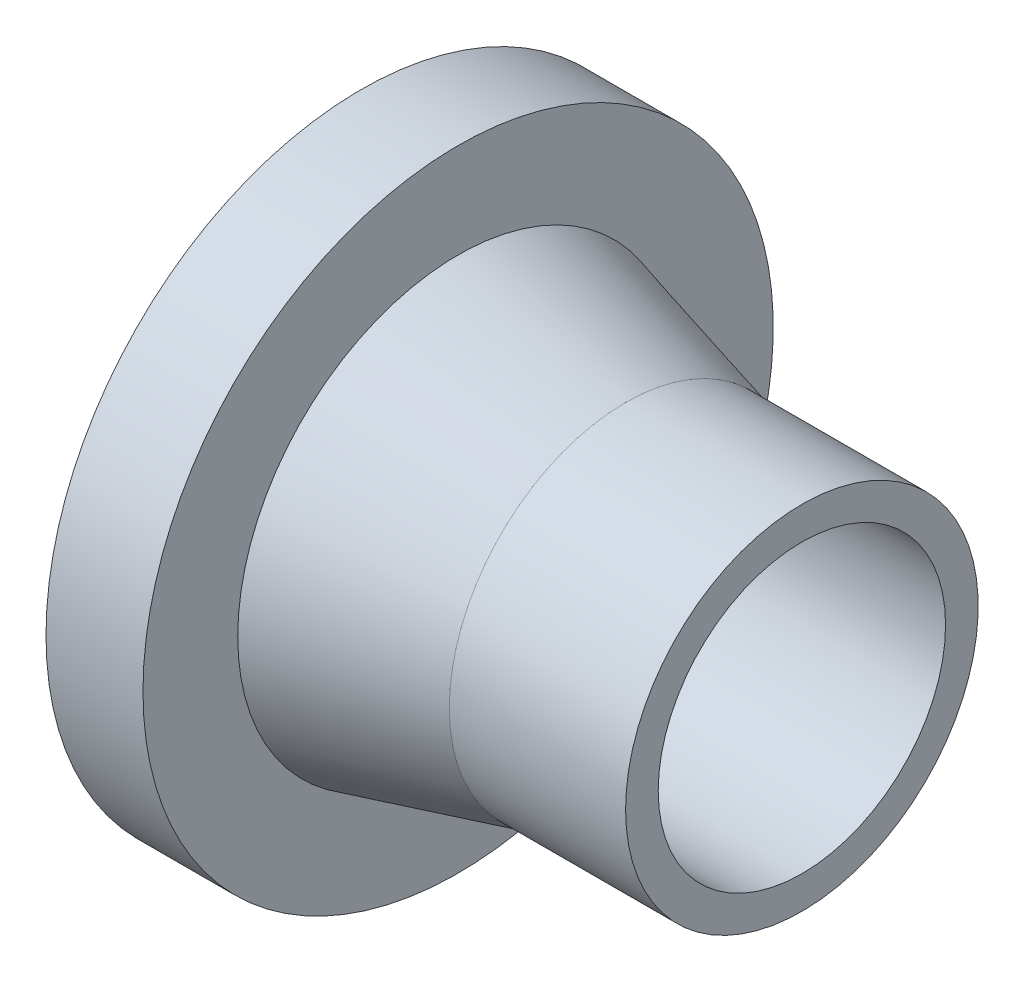
ISO-10303-21;
HEADER;
FILE_DESCRIPTION(('STEP AP214'),'2;1');
FILE_NAME('part.step','',(''),(''),'','','');
FILE_SCHEMA(('AUTOMOTIVE_DESIGN { 1 0 10303 214 1 1 1 1 }'));
ENDSEC;
DATA;
#1=APPLICATION_CONTEXT('core data for automotive mechanical design processes');
#2=APPLICATION_PROTOCOL_DEFINITION('international standard','automotive_design',2000,#1);
#3=PRODUCT_CONTEXT('',#1,'mechanical');
#4=PRODUCT('Part','Part','',(#3));
#5=PRODUCT_RELATED_PRODUCT_CATEGORY('part','',(#4));
#6=PRODUCT_DEFINITION_FORMATION('','',#4);
#7=PRODUCT_DEFINITION_CONTEXT('part definition',#1,'design');
#8=PRODUCT_DEFINITION('design','',#6,#7);
#9=PRODUCT_DEFINITION_SHAPE('','',#8);
#10=(LENGTH_UNIT() NAMED_UNIT(*) SI_UNIT(.MILLI.,.METRE.));
#11=(NAMED_UNIT(*) PLANE_ANGLE_UNIT() SI_UNIT($,.RADIAN.));
#12=(NAMED_UNIT(*) SI_UNIT($,.STERADIAN.) SOLID_ANGLE_UNIT());
#13=UNCERTAINTY_MEASURE_WITH_UNIT(LENGTH_MEASURE(1.E-05),#10,'distance_accuracy_value','');
#14=(GEOMETRIC_REPRESENTATION_CONTEXT(3) GLOBAL_UNCERTAINTY_ASSIGNED_CONTEXT((#13)) GLOBAL_UNIT_ASSIGNED_CONTEXT((#10,
#11,#12)) REPRESENTATION_CONTEXT('',''));
#15=CARTESIAN_POINT('',(0.,0.,0.));
#16=DIRECTION('',(0.,0.,1.));
#17=DIRECTION('',(1.,0.,0.));
#18=AXIS2_PLACEMENT_3D('',#15,#16,#17);
#19=CARTESIAN_POINT('',(-20.,0.,0.));
#20=DIRECTION('',(-1.,0.,0.));
#21=DIRECTION('',(0.,0.,1.));
#22=AXIS2_PLACEMENT_3D('',#19,#20,#21);
#23=CONICAL_SURFACE('',#22,20.,0.257323714971089);
#24=CARTESIAN_POINT('',(-39.,0.,0.));
#25=DIRECTION('',(-1.,0.,0.));
#26=DIRECTION('',(0.,0.,1.));
#27=AXIS2_PLACEMENT_3D('',#24,#25,#26);
#28=CIRCLE('',#27,25.);
#29=CARTESIAN_POINT('',(-39.,0.,25.));
#30=VERTEX_POINT('',#29);
#31=EDGE_CURVE('E16',#30,#30,#28,.T.);
#32=ORIENTED_EDGE('',*,*,#31,.F.);
#33=EDGE_LOOP('',(#32));
#34=FACE_BOUND('',#33,.T.);
#35=CARTESIAN_POINT('',(-20.,0.,0.));
#36=DIRECTION('',(-1.,0.,0.));
#37=DIRECTION('',(0.,1.,0.));
#38=AXIS2_PLACEMENT_3D('',#35,#36,#37);
#39=CIRCLE('',#38,20.);
#40=CARTESIAN_POINT('',(-20.,20.,0.));
#41=VERTEX_POINT('',#40);
#42=EDGE_CURVE('E28',#41,#41,#39,.F.);
#43=ORIENTED_EDGE('',*,*,#42,.F.);
#44=EDGE_LOOP('',(#43));
#45=FACE_BOUND('',#44,.T.);
#46=ADVANCED_FACE('F13',(#34,#45),#23,.T.);
#47=CARTESIAN_POINT('',(-39.,35.75,36.1790021083975));
#48=DIRECTION('',(1.,0.,0.));
#49=DIRECTION('',(0.,-1.,0.));
#50=AXIS2_PLACEMENT_3D('',#47,#48,#49);
#51=PLANE('',#50);
#52=ORIENTED_EDGE('',*,*,#31,.T.);
#53=EDGE_LOOP('',(#52));
#54=FACE_BOUND('',#53,.T.);
#55=CARTESIAN_POINT('',(-39.,0.,0.));
#56=DIRECTION('',(-1.,0.,0.));
#57=DIRECTION('',(0.,0.,1.));
#58=AXIS2_PLACEMENT_3D('',#55,#56,#57);
#59=CIRCLE('',#58,35.75);
#60=CARTESIAN_POINT('',(-39.,0.,35.75));
#61=VERTEX_POINT('',#60);
#62=EDGE_CURVE('E34',#61,#61,#59,.T.);
#63=ORIENTED_EDGE('',*,*,#62,.F.);
#64=EDGE_LOOP('',(#63));
#65=FACE_BOUND('',#64,.T.);
#66=ADVANCED_FACE('F44',(#54,#65),#51,.T.);
#67=CARTESIAN_POINT('',(-20.,0.,0.));
#68=DIRECTION('',(-1.,0.,0.));
#69=DIRECTION('',(0.,0.,1.));
#70=AXIS2_PLACEMENT_3D('',#67,#68,#69);
#71=CYLINDRICAL_SURFACE('',#70,20.);
#72=ORIENTED_EDGE('',*,*,#42,.T.);
#73=EDGE_LOOP('',(#72));
#74=FACE_BOUND('',#73,.T.);
#75=CARTESIAN_POINT('',(0.,0.,0.));
#76=DIRECTION('',(-1.,0.,0.));
#77=DIRECTION('',(0.,0.,1.));
#78=AXIS2_PLACEMENT_3D('',#75,#76,#77);
#79=CIRCLE('',#78,20.);
#80=CARTESIAN_POINT('',(0.,0.,20.));
#81=VERTEX_POINT('',#80);
#82=EDGE_CURVE('E32',#81,#81,#79,.F.);
#83=ORIENTED_EDGE('',*,*,#82,.F.);
#84=EDGE_LOOP('',(#83));
#85=FACE_BOUND('',#84,.T.);
#86=ADVANCED_FACE('F53',(#74,#85),#71,.T.);
#87=CARTESIAN_POINT('',(-50.,0.,0.));
#88=DIRECTION('',(-1.,0.,0.));
#89=DIRECTION('',(0.,0.,1.));
#90=AXIS2_PLACEMENT_3D('',#87,#88,#89);
#91=CYLINDRICAL_SURFACE('',#90,35.75);
#92=CARTESIAN_POINT('',(-50.,0.,0.));
#93=DIRECTION('',(-1.,0.,0.));
#94=DIRECTION('',(0.,0.,1.));
#95=AXIS2_PLACEMENT_3D('',#92,#93,#94);
#96=CIRCLE('',#95,35.75);
#97=CARTESIAN_POINT('',(-50.,0.,35.75));
#98=VERTEX_POINT('',#97);
#99=EDGE_CURVE('E25',#98,#98,#96,.T.);
#100=ORIENTED_EDGE('',*,*,#99,.F.);
#101=EDGE_LOOP('',(#100));
#102=FACE_BOUND('',#101,.T.);
#103=ORIENTED_EDGE('',*,*,#62,.T.);
#104=EDGE_LOOP('',(#103));
#105=FACE_BOUND('',#104,.T.);
#106=ADVANCED_FACE('F68',(#102,#105),#91,.T.);
#107=CARTESIAN_POINT('',(0.,20.,20.2400021083974));
#108=DIRECTION('',(1.,0.,0.));
#109=DIRECTION('',(0.,-1.,0.));
#110=AXIS2_PLACEMENT_3D('',#107,#108,#109);
#111=PLANE('',#110);
#112=CARTESIAN_POINT('',(0.,0.,0.));
#113=DIRECTION('',(-1.,0.,0.));
#114=DIRECTION('',(0.,0.,1.));
#115=AXIS2_PLACEMENT_3D('',#112,#113,#114);
#116=CIRCLE('',#115,16.3);
#117=CARTESIAN_POINT('',(0.,0.,16.3));
#118=VERTEX_POINT('',#117);
#119=EDGE_CURVE('E20',#118,#118,#116,.F.);
#120=ORIENTED_EDGE('',*,*,#119,.F.);
#121=EDGE_LOOP('',(#120));
#122=FACE_BOUND('',#121,.T.);
#123=ORIENTED_EDGE('',*,*,#82,.T.);
#124=EDGE_LOOP('',(#123));
#125=FACE_BOUND('',#124,.T.);
#126=ADVANCED_FACE('F62',(#122,#125),#111,.T.);
#127=CARTESIAN_POINT('',(-50.,-35.75,36.1790021083383));
#128=DIRECTION('',(-1.,0.,0.));
#129=DIRECTION('',(0.,1.,0.));
#130=AXIS2_PLACEMENT_3D('',#127,#128,#129);
#131=PLANE('',#130);
#132=CARTESIAN_POINT('',(-50.,0.,0.));
#133=DIRECTION('',(-1.,0.,0.));
#134=DIRECTION('',(0.,0.,1.));
#135=AXIS2_PLACEMENT_3D('',#132,#133,#134);
#136=CIRCLE('',#135,16.3);
#137=CARTESIAN_POINT('',(-50.,0.,16.3));
#138=VERTEX_POINT('',#137);
#139=EDGE_CURVE('E8',#138,#138,#136,.T.);
#140=ORIENTED_EDGE('',*,*,#139,.F.);
#141=EDGE_LOOP('',(#140));
#142=FACE_BOUND('',#141,.T.);
#143=ORIENTED_EDGE('',*,*,#99,.T.);
#144=EDGE_LOOP('',(#143));
#145=FACE_BOUND('',#144,.T.);
#146=ADVANCED_FACE('F56',(#142,#145),#131,.T.);
#147=CARTESIAN_POINT('',(0.,0.,0.));
#148=DIRECTION('',(-1.,0.,0.));
#149=DIRECTION('',(0.,0.,1.));
#150=AXIS2_PLACEMENT_3D('',#147,#148,#149);
#151=CYLINDRICAL_SURFACE('',#150,16.3);
#152=ORIENTED_EDGE('',*,*,#119,.T.);
#153=EDGE_LOOP('',(#152));
#154=FACE_BOUND('',#153,.T.);
#155=ORIENTED_EDGE('',*,*,#139,.T.);
#156=EDGE_LOOP('',(#155));
#157=FACE_BOUND('',#156,.T.);
#158=ADVANCED_FACE('F54',(#154,#157),#151,.F.);
#159=CLOSED_SHELL('',(#46,#66,#86,#106,#126,#146,#158));
#160=MANIFOLD_SOLID_BREP('B1',#159);
#161=ADVANCED_BREP_SHAPE_REPRESENTATION('',(#18,#160),#14);
#162=SHAPE_DEFINITION_REPRESENTATION(#9,#161);
ENDSEC;
END-ISO-10303-21;
